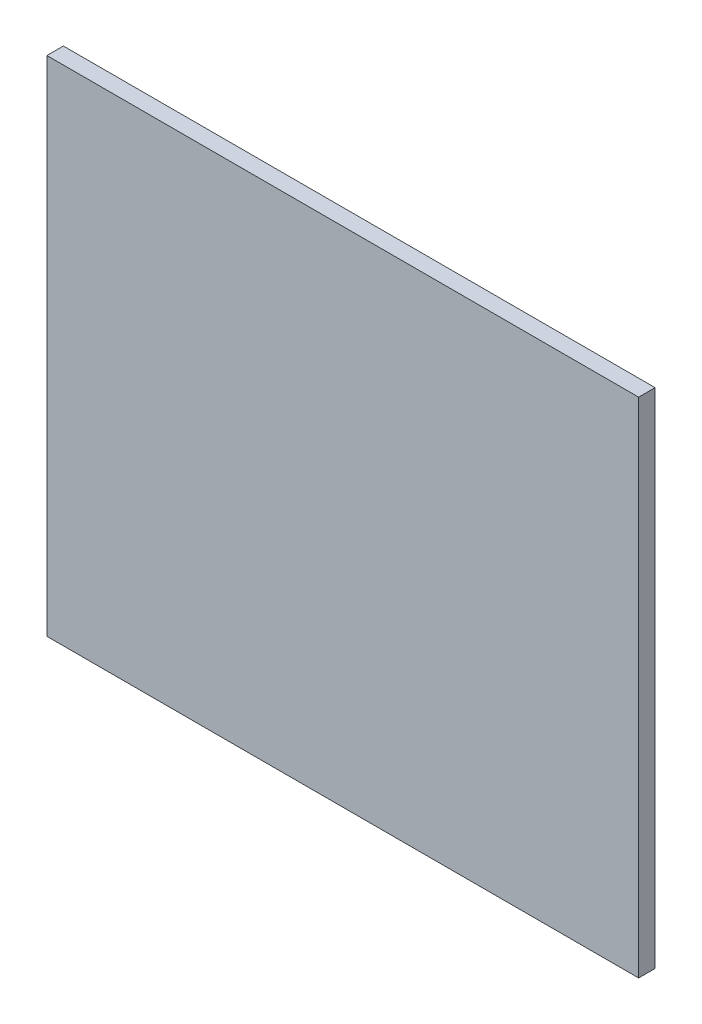
ISO-10303-21;
HEADER;
FILE_DESCRIPTION(('STEP AP214'),'2;1');
FILE_NAME('part.step','',(''),(''),'','','');
FILE_SCHEMA(('AUTOMOTIVE_DESIGN { 1 0 10303 214 1 1 1 1 }'));
ENDSEC;
DATA;
#1=APPLICATION_CONTEXT('core data for automotive mechanical design processes');
#2=APPLICATION_PROTOCOL_DEFINITION('international standard','automotive_design',2000,#1);
#3=PRODUCT_CONTEXT('',#1,'mechanical');
#4=PRODUCT('Part','Part','',(#3));
#5=PRODUCT_RELATED_PRODUCT_CATEGORY('part','',(#4));
#6=PRODUCT_DEFINITION_FORMATION('','',#4);
#7=PRODUCT_DEFINITION_CONTEXT('part definition',#1,'design');
#8=PRODUCT_DEFINITION('design','',#6,#7);
#9=PRODUCT_DEFINITION_SHAPE('','',#8);
#10=(LENGTH_UNIT() NAMED_UNIT(*) SI_UNIT(.MILLI.,.METRE.));
#11=(NAMED_UNIT(*) PLANE_ANGLE_UNIT() SI_UNIT($,.RADIAN.));
#12=(NAMED_UNIT(*) SI_UNIT($,.STERADIAN.) SOLID_ANGLE_UNIT());
#13=UNCERTAINTY_MEASURE_WITH_UNIT(LENGTH_MEASURE(1.E-05),#10,'distance_accuracy_value','');
#14=(GEOMETRIC_REPRESENTATION_CONTEXT(3) GLOBAL_UNCERTAINTY_ASSIGNED_CONTEXT((#13)) GLOBAL_UNIT_ASSIGNED_CONTEXT((#10,
#11,#12)) REPRESENTATION_CONTEXT('',''));
#15=CARTESIAN_POINT('',(0.,0.,0.));
#16=DIRECTION('',(0.,0.,1.));
#17=DIRECTION('',(1.,0.,0.));
#18=AXIS2_PLACEMENT_3D('',#15,#16,#17);
#19=CARTESIAN_POINT('',(-323.5,-275.,18.));
#20=DIRECTION('',(1.,0.,0.));
#21=DIRECTION('',(0.,0.,-1.));
#22=AXIS2_PLACEMENT_3D('',#19,#20,#21);
#23=PLANE('',#22);
#24=DIRECTION('',(0.,-1.,0.));
#25=VECTOR('',#24,1.);
#26=CARTESIAN_POINT('',(-323.5,-275.,0.));
#27=LINE('',#26,#25);
#28=CARTESIAN_POINT('',(-323.5,275.,0.));
#29=VERTEX_POINT('',#28);
#30=CARTESIAN_POINT('',(-323.5,-275.,0.));
#31=VERTEX_POINT('',#30);
#32=EDGE_CURVE('E96',#29,#31,#27,.T.);
#33=ORIENTED_EDGE('',*,*,#32,.T.);
#34=DIRECTION('',(0.,0.,-1.));
#35=VECTOR('',#34,1.);
#36=CARTESIAN_POINT('',(-323.5,-275.,18.));
#37=LINE('',#36,#35);
#38=CARTESIAN_POINT('',(-323.5,-275.,18.));
#39=VERTEX_POINT('',#38);
#40=EDGE_CURVE('E11',#39,#31,#37,.T.);
#41=ORIENTED_EDGE('',*,*,#40,.F.);
#42=DIRECTION('',(0.,-1.,0.));
#43=VECTOR('',#42,1.);
#44=CARTESIAN_POINT('',(-323.5,-275.,18.));
#45=LINE('',#44,#43);
#46=CARTESIAN_POINT('',(-323.5,275.,18.));
#47=VERTEX_POINT('',#46);
#48=EDGE_CURVE('E84',#47,#39,#45,.T.);
#49=ORIENTED_EDGE('',*,*,#48,.F.);
#50=DIRECTION('',(0.,0.,-1.));
#51=VECTOR('',#50,1.);
#52=CARTESIAN_POINT('',(-323.5,275.,18.));
#53=LINE('',#52,#51);
#54=EDGE_CURVE('E92',#47,#29,#53,.T.);
#55=ORIENTED_EDGE('',*,*,#54,.T.);
#56=EDGE_LOOP('',(#33,#41,#49,#55));
#57=FACE_BOUND('',#56,.T.);
#58=ADVANCED_FACE('F33',(#57),#23,.F.);
#59=CARTESIAN_POINT('',(323.5,-275.,18.));
#60=DIRECTION('',(0.,1.,0.));
#61=DIRECTION('',(-1.,0.,0.));
#62=AXIS2_PLACEMENT_3D('',#59,#60,#61);
#63=PLANE('',#62);
#64=DIRECTION('',(1.,0.,0.));
#65=VECTOR('',#64,1.);
#66=CARTESIAN_POINT('',(323.5,-275.,0.));
#67=LINE('',#66,#65);
#68=CARTESIAN_POINT('',(323.5,-275.,0.));
#69=VERTEX_POINT('',#68);
#70=EDGE_CURVE('E88',#31,#69,#67,.T.);
#71=ORIENTED_EDGE('',*,*,#70,.T.);
#72=DIRECTION('',(0.,0.,-1.));
#73=VECTOR('',#72,1.);
#74=CARTESIAN_POINT('',(323.5,-275.,18.));
#75=LINE('',#74,#73);
#76=CARTESIAN_POINT('',(323.5,-275.,18.));
#77=VERTEX_POINT('',#76);
#78=EDGE_CURVE('E41',#77,#69,#75,.T.);
#79=ORIENTED_EDGE('',*,*,#78,.F.);
#80=DIRECTION('',(1.,0.,0.));
#81=VECTOR('',#80,1.);
#82=CARTESIAN_POINT('',(323.5,-275.,18.));
#83=LINE('',#82,#81);
#84=EDGE_CURVE('E79',#39,#77,#83,.T.);
#85=ORIENTED_EDGE('',*,*,#84,.F.);
#86=ORIENTED_EDGE('',*,*,#40,.T.);
#87=EDGE_LOOP('',(#71,#79,#85,#86));
#88=FACE_BOUND('',#87,.T.);
#89=ADVANCED_FACE('F87',(#88),#63,.F.);
#90=CARTESIAN_POINT('',(323.5,-275.,18.));
#91=DIRECTION('',(-1.,0.,0.));
#92=DIRECTION('',(0.,0.,1.));
#93=AXIS2_PLACEMENT_3D('',#90,#91,#92);
#94=PLANE('',#93);
#95=DIRECTION('',(0.,1.,0.));
#96=VECTOR('',#95,1.);
#97=CARTESIAN_POINT('',(323.5,-275.,0.));
#98=LINE('',#97,#96);
#99=CARTESIAN_POINT('',(323.5,275.,0.));
#100=VERTEX_POINT('',#99);
#101=EDGE_CURVE('E66',#69,#100,#98,.T.);
#102=ORIENTED_EDGE('',*,*,#101,.T.);
#103=DIRECTION('',(0.,0.,-1.));
#104=VECTOR('',#103,1.);
#105=CARTESIAN_POINT('',(323.5,275.,18.));
#106=LINE('',#105,#104);
#107=CARTESIAN_POINT('',(323.5,275.,18.));
#108=VERTEX_POINT('',#107);
#109=EDGE_CURVE('E89',#108,#100,#106,.T.);
#110=ORIENTED_EDGE('',*,*,#109,.F.);
#111=DIRECTION('',(0.,1.,0.));
#112=VECTOR('',#111,1.);
#113=CARTESIAN_POINT('',(323.5,-275.,18.));
#114=LINE('',#113,#112);
#115=EDGE_CURVE('E82',#77,#108,#114,.T.);
#116=ORIENTED_EDGE('',*,*,#115,.F.);
#117=ORIENTED_EDGE('',*,*,#78,.T.);
#118=EDGE_LOOP('',(#102,#110,#116,#117));
#119=FACE_BOUND('',#118,.T.);
#120=ADVANCED_FACE('F90',(#119),#94,.F.);
#121=CARTESIAN_POINT('',(323.5,275.,18.));
#122=DIRECTION('',(0.,-1.,0.));
#123=DIRECTION('',(1.,0.,0.));
#124=AXIS2_PLACEMENT_3D('',#121,#122,#123);
#125=PLANE('',#124);
#126=DIRECTION('',(-1.,0.,0.));
#127=VECTOR('',#126,1.);
#128=CARTESIAN_POINT('',(323.5,275.,0.));
#129=LINE('',#128,#127);
#130=EDGE_CURVE('E72',#100,#29,#129,.T.);
#131=ORIENTED_EDGE('',*,*,#130,.T.);
#132=ORIENTED_EDGE('',*,*,#54,.F.);
#133=DIRECTION('',(-1.,0.,0.));
#134=VECTOR('',#133,1.);
#135=CARTESIAN_POINT('',(323.5,275.,18.));
#136=LINE('',#135,#134);
#137=EDGE_CURVE('E49',#108,#47,#136,.T.);
#138=ORIENTED_EDGE('',*,*,#137,.F.);
#139=ORIENTED_EDGE('',*,*,#109,.T.);
#140=EDGE_LOOP('',(#131,#132,#138,#139));
#141=FACE_BOUND('',#140,.T.);
#142=ADVANCED_FACE('F103',(#141),#125,.F.);
#143=CARTESIAN_POINT('',(0.,0.,18.));
#144=DIRECTION('',(0.,0.,1.));
#145=DIRECTION('',(1.,0.,0.));
#146=AXIS2_PLACEMENT_3D('',#143,#144,#145);
#147=PLANE('',#146);
#148=ORIENTED_EDGE('',*,*,#48,.T.);
#149=ORIENTED_EDGE('',*,*,#84,.T.);
#150=ORIENTED_EDGE('',*,*,#115,.T.);
#151=ORIENTED_EDGE('',*,*,#137,.T.);
#152=EDGE_LOOP('',(#148,#149,#150,#151));
#153=FACE_BOUND('',#152,.T.);
#154=ADVANCED_FACE('F80',(#153),#147,.T.);
#155=CARTESIAN_POINT('',(0.,0.,0.));
#156=DIRECTION('',(0.,0.,1.));
#157=DIRECTION('',(1.,0.,0.));
#158=AXIS2_PLACEMENT_3D('',#155,#156,#157);
#159=PLANE('',#158);
#160=ORIENTED_EDGE('',*,*,#32,.F.);
#161=ORIENTED_EDGE('',*,*,#130,.F.);
#162=ORIENTED_EDGE('',*,*,#101,.F.);
#163=ORIENTED_EDGE('',*,*,#70,.F.);
#164=EDGE_LOOP('',(#160,#161,#162,#163));
#165=FACE_BOUND('',#164,.T.);
#166=ADVANCED_FACE('F106',(#165),#159,.F.);
#167=CLOSED_SHELL('',(#58,#89,#120,#142,#154,#166));
#168=MANIFOLD_SOLID_BREP('B2',#167);
#169=ADVANCED_BREP_SHAPE_REPRESENTATION('',(#18,#168),#14);
#170=SHAPE_DEFINITION_REPRESENTATION(#9,#169);
ENDSEC;
END-ISO-10303-21;
